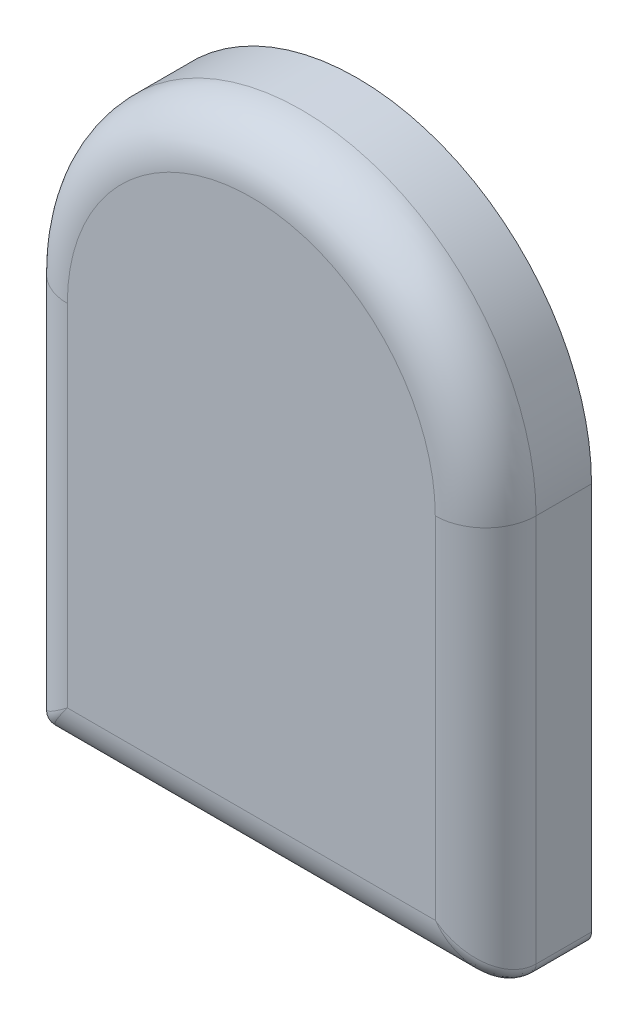
ISO-10303-21;
HEADER;
FILE_DESCRIPTION(('STEP AP214'),'2;1');
FILE_NAME('part.step','',(''),(''),'','','');
FILE_SCHEMA(('AUTOMOTIVE_DESIGN { 1 0 10303 214 1 1 1 1 }'));
ENDSEC;
DATA;
#1=APPLICATION_CONTEXT('core data for automotive mechanical design processes');
#2=APPLICATION_PROTOCOL_DEFINITION('international standard','automotive_design',2000,#1);
#3=PRODUCT_CONTEXT('',#1,'mechanical');
#4=PRODUCT('Part','Part','',(#3));
#5=PRODUCT_RELATED_PRODUCT_CATEGORY('part','',(#4));
#6=PRODUCT_DEFINITION_FORMATION('','',#4);
#7=PRODUCT_DEFINITION_CONTEXT('part definition',#1,'design');
#8=PRODUCT_DEFINITION('design','',#6,#7);
#9=PRODUCT_DEFINITION_SHAPE('','',#8);
#10=(LENGTH_UNIT() NAMED_UNIT(*) SI_UNIT(.MILLI.,.METRE.));
#11=(NAMED_UNIT(*) PLANE_ANGLE_UNIT() SI_UNIT($,.RADIAN.));
#12=(NAMED_UNIT(*) SI_UNIT($,.STERADIAN.) SOLID_ANGLE_UNIT());
#13=UNCERTAINTY_MEASURE_WITH_UNIT(LENGTH_MEASURE(1.E-05),#10,'distance_accuracy_value','');
#14=(GEOMETRIC_REPRESENTATION_CONTEXT(3) GLOBAL_UNCERTAINTY_ASSIGNED_CONTEXT((#13)) GLOBAL_UNIT_ASSIGNED_CONTEXT((#10,
#11,#12)) REPRESENTATION_CONTEXT('',''));
#15=CARTESIAN_POINT('',(0.,0.,0.));
#16=DIRECTION('',(0.,0.,1.));
#17=DIRECTION('',(1.,0.,0.));
#18=AXIS2_PLACEMENT_3D('',#15,#16,#17);
#19=CARTESIAN_POINT('',(8.8,-12.1,4.2));
#20=DIRECTION('',(0.,0.,-1.));
#21=DIRECTION('',(-1.,0.,0.));
#22=AXIS2_PLACEMENT_3D('',#19,#20,#21);
#23=CYLINDRICAL_SURFACE('',#22,0.5);
#24=DIRECTION('',(0.,0.,-1.));
#25=VECTOR('',#24,1.);
#26=CARTESIAN_POINT('',(9.3,-12.1,4.2));
#27=LINE('',#26,#25);
#28=CARTESIAN_POINT('',(9.3,-12.1,2.2));
#29=VERTEX_POINT('',#28);
#30=CARTESIAN_POINT('',(9.3,-12.1,0.));
#31=VERTEX_POINT('',#30);
#32=EDGE_CURVE('E104',#29,#31,#27,.T.);
#33=ORIENTED_EDGE('',*,*,#32,.F.);
#34=CARTESIAN_POINT('',(8.8,-12.1,2.2));
#35=DIRECTION('',(0.,0.,-1.));
#36=DIRECTION('',(-1.,0.,0.));
#37=AXIS2_PLACEMENT_3D('',#34,#35,#36);
#38=CIRCLE('',#37,0.5);
#39=CARTESIAN_POINT('',(8.8,-12.6,2.2));
#40=VERTEX_POINT('',#39);
#41=EDGE_CURVE('E162',#29,#40,#38,.T.);
#42=ORIENTED_EDGE('',*,*,#41,.T.);
#43=DIRECTION('',(0.,0.,-1.));
#44=VECTOR('',#43,1.);
#45=CARTESIAN_POINT('',(8.8,-12.6,4.2));
#46=LINE('',#45,#44);
#47=CARTESIAN_POINT('',(8.8,-12.6,0.));
#48=VERTEX_POINT('',#47);
#49=EDGE_CURVE('E128',#40,#48,#46,.T.);
#50=ORIENTED_EDGE('',*,*,#49,.T.);
#51=CARTESIAN_POINT('',(8.8,-12.1,0.));
#52=DIRECTION('',(0.,0.,1.));
#53=DIRECTION('',(1.,0.,0.));
#54=AXIS2_PLACEMENT_3D('',#51,#52,#53);
#55=CIRCLE('',#54,0.5);
#56=EDGE_CURVE('E122',#48,#31,#55,.T.);
#57=ORIENTED_EDGE('',*,*,#56,.T.);
#58=EDGE_LOOP('',(#33,#42,#50,#57));
#59=FACE_BOUND('',#58,.T.);
#60=ADVANCED_FACE('F39',(#59),#23,.T.);
#61=CARTESIAN_POINT('',(9.3,3.3,4.2));
#62=DIRECTION('',(-1.,0.,0.));
#63=DIRECTION('',(0.,0.,1.));
#64=AXIS2_PLACEMENT_3D('',#61,#62,#63);
#65=PLANE('',#64);
#66=DIRECTION('',(0.,0.,-1.));
#67=VECTOR('',#66,1.);
#68=CARTESIAN_POINT('',(9.3,3.3,4.2));
#69=LINE('',#68,#67);
#70=CARTESIAN_POINT('',(9.3,3.3,2.2));
#71=VERTEX_POINT('',#70);
#72=CARTESIAN_POINT('',(9.3,3.3,0.));
#73=VERTEX_POINT('',#72);
#74=EDGE_CURVE('E116',#71,#73,#69,.T.);
#75=ORIENTED_EDGE('',*,*,#74,.F.);
#76=DIRECTION('',(0.,1.,0.));
#77=VECTOR('',#76,1.);
#78=CARTESIAN_POINT('',(9.3,-12.1,2.2));
#79=LINE('',#78,#77);
#80=EDGE_CURVE('E111',#71,#29,#79,.F.);
#81=ORIENTED_EDGE('',*,*,#80,.T.);
#82=ORIENTED_EDGE('',*,*,#32,.T.);
#83=DIRECTION('',(0.,1.,0.));
#84=VECTOR('',#83,1.);
#85=CARTESIAN_POINT('',(9.3,3.3,0.));
#86=LINE('',#85,#84);
#87=EDGE_CURVE('E108',#31,#73,#86,.T.);
#88=ORIENTED_EDGE('',*,*,#87,.T.);
#89=EDGE_LOOP('',(#75,#81,#82,#88));
#90=FACE_BOUND('',#89,.T.);
#91=ADVANCED_FACE('F107',(#90),#65,.F.);
#92=CARTESIAN_POINT('',(0.,3.3,4.2));
#93=DIRECTION('',(0.,0.,-1.));
#94=DIRECTION('',(-1.,0.,0.));
#95=AXIS2_PLACEMENT_3D('',#92,#93,#94);
#96=CYLINDRICAL_SURFACE('',#95,9.3);
#97=DIRECTION('',(0.,0.,-1.));
#98=VECTOR('',#97,1.);
#99=CARTESIAN_POINT('',(-9.3,3.3,4.2));
#100=LINE('',#99,#98);
#101=CARTESIAN_POINT('',(-9.3,3.3,2.2));
#102=VERTEX_POINT('',#101);
#103=CARTESIAN_POINT('',(-9.3,3.3,0.));
#104=VERTEX_POINT('',#103);
#105=EDGE_CURVE('E148',#102,#104,#100,.T.);
#106=ORIENTED_EDGE('',*,*,#105,.F.);
#107=CARTESIAN_POINT('',(0.,3.3,2.2));
#108=DIRECTION('',(0.,0.,1.));
#109=DIRECTION('',(1.,0.,0.));
#110=AXIS2_PLACEMENT_3D('',#107,#108,#109);
#111=CIRCLE('',#110,9.3);
#112=EDGE_CURVE('E165',#102,#71,#111,.F.);
#113=ORIENTED_EDGE('',*,*,#112,.T.);
#114=ORIENTED_EDGE('',*,*,#74,.T.);
#115=CARTESIAN_POINT('',(0.,3.3,0.));
#116=DIRECTION('',(0.,0.,1.));
#117=DIRECTION('',(1.,0.,0.));
#118=AXIS2_PLACEMENT_3D('',#115,#116,#117);
#119=CIRCLE('',#118,9.3);
#120=EDGE_CURVE('E125',#73,#104,#119,.T.);
#121=ORIENTED_EDGE('',*,*,#120,.T.);
#122=EDGE_LOOP('',(#106,#113,#114,#121));
#123=FACE_BOUND('',#122,.T.);
#124=ADVANCED_FACE('F217',(#123),#96,.T.);
#125=CARTESIAN_POINT('',(-9.3,-12.1,4.2));
#126=DIRECTION('',(1.,0.,0.));
#127=DIRECTION('',(0.,1.,0.));
#128=AXIS2_PLACEMENT_3D('',#125,#126,#127);
#129=PLANE('',#128);
#130=DIRECTION('',(0.,0.,-1.));
#131=VECTOR('',#130,1.);
#132=CARTESIAN_POINT('',(-9.3,-12.1,4.2));
#133=LINE('',#132,#131);
#134=CARTESIAN_POINT('',(-9.3,-12.1,2.2));
#135=VERTEX_POINT('',#134);
#136=CARTESIAN_POINT('',(-9.3,-12.1,0.));
#137=VERTEX_POINT('',#136);
#138=EDGE_CURVE('E146',#135,#137,#133,.T.);
#139=ORIENTED_EDGE('',*,*,#138,.F.);
#140=DIRECTION('',(0.,-1.,0.));
#141=VECTOR('',#140,1.);
#142=CARTESIAN_POINT('',(-9.3,3.3,2.2));
#143=LINE('',#142,#141);
#144=EDGE_CURVE('E48',#135,#102,#143,.F.);
#145=ORIENTED_EDGE('',*,*,#144,.T.);
#146=ORIENTED_EDGE('',*,*,#105,.T.);
#147=DIRECTION('',(0.,-1.,0.));
#148=VECTOR('',#147,1.);
#149=CARTESIAN_POINT('',(-9.3,-12.1,0.));
#150=LINE('',#149,#148);
#151=EDGE_CURVE('E135',#104,#137,#150,.T.);
#152=ORIENTED_EDGE('',*,*,#151,.T.);
#153=EDGE_LOOP('',(#139,#145,#146,#152));
#154=FACE_BOUND('',#153,.T.);
#155=ADVANCED_FACE('F218',(#154),#129,.F.);
#156=CARTESIAN_POINT('',(-8.8,-12.1,4.2));
#157=DIRECTION('',(0.,0.,-1.));
#158=DIRECTION('',(-1.,0.,0.));
#159=AXIS2_PLACEMENT_3D('',#156,#157,#158);
#160=CYLINDRICAL_SURFACE('',#159,0.5);
#161=DIRECTION('',(0.,0.,-1.));
#162=VECTOR('',#161,1.);
#163=CARTESIAN_POINT('',(-8.8,-12.6,4.2));
#164=LINE('',#163,#162);
#165=CARTESIAN_POINT('',(-8.8,-12.6,2.2));
#166=VERTEX_POINT('',#165);
#167=CARTESIAN_POINT('',(-8.8,-12.6,0.));
#168=VERTEX_POINT('',#167);
#169=EDGE_CURVE('E144',#166,#168,#164,.T.);
#170=ORIENTED_EDGE('',*,*,#169,.F.);
#171=CARTESIAN_POINT('',(-8.8,-12.1,2.2));
#172=DIRECTION('',(0.,0.,-1.));
#173=DIRECTION('',(-1.,0.,0.));
#174=AXIS2_PLACEMENT_3D('',#171,#172,#173);
#175=CIRCLE('',#174,0.5);
#176=EDGE_CURVE('E11',#166,#135,#175,.T.);
#177=ORIENTED_EDGE('',*,*,#176,.T.);
#178=ORIENTED_EDGE('',*,*,#138,.T.);
#179=CARTESIAN_POINT('',(-8.8,-12.1,0.));
#180=DIRECTION('',(0.,0.,1.));
#181=DIRECTION('',(1.,0.,0.));
#182=AXIS2_PLACEMENT_3D('',#179,#180,#181);
#183=CIRCLE('',#182,0.5);
#184=EDGE_CURVE('E138',#137,#168,#183,.T.);
#185=ORIENTED_EDGE('',*,*,#184,.T.);
#186=EDGE_LOOP('',(#170,#177,#178,#185));
#187=FACE_BOUND('',#186,.T.);
#188=ADVANCED_FACE('F220',(#187),#160,.T.);
#189=CARTESIAN_POINT('',(8.8,-12.6,4.2));
#190=DIRECTION('',(0.,1.,0.));
#191=DIRECTION('',(0.,0.,1.));
#192=AXIS2_PLACEMENT_3D('',#189,#190,#191);
#193=PLANE('',#192);
#194=ORIENTED_EDGE('',*,*,#49,.F.);
#195=DIRECTION('',(1.,0.,0.));
#196=VECTOR('',#195,1.);
#197=CARTESIAN_POINT('',(-8.8,-12.6,2.2));
#198=LINE('',#197,#196);
#199=EDGE_CURVE('E159',#40,#166,#198,.F.);
#200=ORIENTED_EDGE('',*,*,#199,.T.);
#201=ORIENTED_EDGE('',*,*,#169,.T.);
#202=DIRECTION('',(1.,0.,0.));
#203=VECTOR('',#202,1.);
#204=CARTESIAN_POINT('',(8.8,-12.6,0.));
#205=LINE('',#204,#203);
#206=EDGE_CURVE('E141',#168,#48,#205,.T.);
#207=ORIENTED_EDGE('',*,*,#206,.T.);
#208=EDGE_LOOP('',(#194,#200,#201,#207));
#209=FACE_BOUND('',#208,.T.);
#210=ADVANCED_FACE('F222',(#209),#193,.F.);
#211=CARTESIAN_POINT('',(8.8,-12.1,4.2));
#212=DIRECTION('',(0.,0.,1.));
#213=DIRECTION('',(1.,0.,0.));
#214=AXIS2_PLACEMENT_3D('',#211,#212,#213);
#215=PLANE('',#214);
#216=DIRECTION('',(0.,-1.,0.));
#217=VECTOR('',#216,1.);
#218=CARTESIAN_POINT('',(-7.3,-12.1,4.2));
#219=LINE('',#218,#217);
#220=CARTESIAN_POINT('',(-7.3,3.3,4.2));
#221=VERTEX_POINT('',#220);
#222=CARTESIAN_POINT('',(-7.3,-10.6,4.2));
#223=VERTEX_POINT('',#222);
#224=EDGE_CURVE('E115',#221,#223,#219,.T.);
#225=ORIENTED_EDGE('',*,*,#224,.T.);
#226=DIRECTION('',(1.,0.,0.));
#227=VECTOR('',#226,1.);
#228=CARTESIAN_POINT('',(8.8,-10.6,4.2));
#229=LINE('',#228,#227);
#230=CARTESIAN_POINT('',(7.3,-10.6,4.2));
#231=VERTEX_POINT('',#230);
#232=EDGE_CURVE('E156',#223,#231,#229,.T.);
#233=ORIENTED_EDGE('',*,*,#232,.T.);
#234=DIRECTION('',(0.,1.,0.));
#235=VECTOR('',#234,1.);
#236=CARTESIAN_POINT('',(7.3,3.3,4.2));
#237=LINE('',#236,#235);
#238=CARTESIAN_POINT('',(7.3,3.3,4.2));
#239=VERTEX_POINT('',#238);
#240=EDGE_CURVE('E154',#231,#239,#237,.T.);
#241=ORIENTED_EDGE('',*,*,#240,.T.);
#242=CARTESIAN_POINT('',(0.,3.3,4.2));
#243=DIRECTION('',(0.,0.,1.));
#244=DIRECTION('',(1.,0.,0.));
#245=AXIS2_PLACEMENT_3D('',#242,#243,#244);
#246=CIRCLE('',#245,7.3);
#247=EDGE_CURVE('E152',#239,#221,#246,.T.);
#248=ORIENTED_EDGE('',*,*,#247,.T.);
#249=EDGE_LOOP('',(#225,#233,#241,#248));
#250=FACE_BOUND('',#249,.T.);
#251=ADVANCED_FACE('F228',(#250),#215,.T.);
#252=CARTESIAN_POINT('',(8.8,-12.1,0.));
#253=DIRECTION('',(0.,0.,1.));
#254=DIRECTION('',(1.,0.,0.));
#255=AXIS2_PLACEMENT_3D('',#252,#253,#254);
#256=PLANE('',#255);
#257=ORIENTED_EDGE('',*,*,#56,.F.);
#258=ORIENTED_EDGE('',*,*,#206,.F.);
#259=ORIENTED_EDGE('',*,*,#184,.F.);
#260=ORIENTED_EDGE('',*,*,#151,.F.);
#261=ORIENTED_EDGE('',*,*,#120,.F.);
#262=ORIENTED_EDGE('',*,*,#87,.F.);
#263=EDGE_LOOP('',(#257,#258,#259,#260,#261,#262));
#264=FACE_BOUND('',#263,.T.);
#265=ADVANCED_FACE('F120',(#264),#256,.F.);
#266=CARTESIAN_POINT('',(0.,3.3,2.2));
#267=DIRECTION('',(0.,0.,1.));
#268=DIRECTION('',(1.,0.,0.));
#269=AXIS2_PLACEMENT_3D('',#266,#267,#268);
#270=TOROIDAL_SURFACE('',#269,7.3,2.);
#271=CARTESIAN_POINT('',(7.3,3.3,2.2));
#272=DIRECTION('',(0.,-1.,0.));
#273=DIRECTION('',(0.,0.,-1.));
#274=AXIS2_PLACEMENT_3D('',#271,#272,#273);
#275=CIRCLE('',#274,2.);
#276=EDGE_CURVE('E132',#71,#239,#275,.T.);
#277=ORIENTED_EDGE('',*,*,#276,.F.);
#278=ORIENTED_EDGE('',*,*,#112,.F.);
#279=CARTESIAN_POINT('',(-7.3,3.3,2.2));
#280=DIRECTION('',(0.,-1.,0.));
#281=DIRECTION('',(1.,0.,0.));
#282=AXIS2_PLACEMENT_3D('',#279,#280,#281);
#283=CIRCLE('',#282,2.);
#284=EDGE_CURVE('E43',#221,#102,#283,.T.);
#285=ORIENTED_EDGE('',*,*,#284,.F.);
#286=ORIENTED_EDGE('',*,*,#247,.F.);
#287=EDGE_LOOP('',(#277,#278,#285,#286));
#288=FACE_BOUND('',#287,.T.);
#289=ADVANCED_FACE('F41',(#288),#270,.T.);
#290=CARTESIAN_POINT('',(-7.3,-12.1,2.2));
#291=DIRECTION('',(0.,1.,0.));
#292=DIRECTION('',(-1.,0.,0.));
#293=AXIS2_PLACEMENT_3D('',#290,#291,#292);
#294=CYLINDRICAL_SURFACE('',#293,2.);
#295=ORIENTED_EDGE('',*,*,#284,.T.);
#296=ORIENTED_EDGE('',*,*,#144,.F.);
#297=CARTESIAN_POINT('',(-7.3,-10.6,2.2));
#298=DIRECTION('',(0.6,-0.8,0.));
#299=DIRECTION('',(-0.8,-0.6,0.));
#300=AXIS2_PLACEMENT_3D('',#297,#298,#299);
#301=ELLIPSE('',#300,2.5,2.);
#302=EDGE_CURVE('E175',#223,#135,#301,.T.);
#303=ORIENTED_EDGE('',*,*,#302,.F.);
#304=ORIENTED_EDGE('',*,*,#224,.F.);
#305=EDGE_LOOP('',(#295,#296,#303,#304));
#306=FACE_BOUND('',#305,.T.);
#307=ADVANCED_FACE('F195',(#306),#294,.T.);
#308=CARTESIAN_POINT('',(7.3,-12.1,2.2));
#309=DIRECTION('',(0.,-1.,0.));
#310=DIRECTION('',(0.,0.,-1.));
#311=AXIS2_PLACEMENT_3D('',#308,#309,#310);
#312=CYLINDRICAL_SURFACE('',#311,2.);
#313=ORIENTED_EDGE('',*,*,#276,.T.);
#314=ORIENTED_EDGE('',*,*,#240,.F.);
#315=CARTESIAN_POINT('',(7.3,-10.6,2.2));
#316=DIRECTION('',(0.6,0.8,0.));
#317=DIRECTION('',(0.8,-0.6,0.));
#318=AXIS2_PLACEMENT_3D('',#315,#316,#317);
#319=ELLIPSE('',#318,2.5,2.);
#320=EDGE_CURVE('E172',#29,#231,#319,.F.);
#321=ORIENTED_EDGE('',*,*,#320,.F.);
#322=ORIENTED_EDGE('',*,*,#80,.F.);
#323=EDGE_LOOP('',(#313,#314,#321,#322));
#324=FACE_BOUND('',#323,.T.);
#325=ADVANCED_FACE('F191',(#324),#312,.T.);
#326=CARTESIAN_POINT('',(-7.3,-10.6,0.200000000000001));
#327=CARTESIAN_POINT('',(-7.3,-10.6,0.200000000000001));
#328=CARTESIAN_POINT('',(-7.3,-10.6,0.200000000000001));
#329=CARTESIAN_POINT('',(-7.36534712065569,-10.6871294942076,0.200035055250015));
#330=CARTESIAN_POINT('',(-7.37625301968526,-10.6762530196853,0.199976339095898));
#331=CARTESIAN_POINT('',(-7.38712949420759,-10.6653471206557,0.200035055250015));
#332=CARTESIAN_POINT('',(-7.43071092668624,-10.7742812355817,0.205696487430835));
#333=CARTESIAN_POINT('',(-7.45271669848803,-10.752716698488,0.204277360821934));
#334=CARTESIAN_POINT('',(-7.47428123558166,-10.7307109266862,0.205696487430835));
#335=CARTESIAN_POINT('',(-7.56031449090428,-10.9470859878724,0.228427051088899));
#336=CARTESIAN_POINT('',(-7.60446975212246,-10.9044697521225,0.22140059823371));
#337=CARTESIAN_POINT('',(-7.64708598787237,-10.8603144909043,0.228427051088899));
#338=CARTESIAN_POINT('',(-7.62455908096206,-11.0327454412827,0.245398809321809));
#339=CARTESIAN_POINT('',(-7.68019165762918,-10.9801916576292,0.234247025705178));
#340=CARTESIAN_POINT('',(-7.73274544128274,-10.9245590809621,0.245398809321809));
#341=CARTESIAN_POINT('',(-7.75083012894728,-11.2011068385964,0.290516308556291));
#342=CARTESIAN_POINT('',(-7.82973753195478,-11.1297375319548,0.268479521630331));
#343=CARTESIAN_POINT('',(-7.90110683859638,-11.0508301289473,0.290516308556291));
#344=CARTESIAN_POINT('',(-7.81287571744484,-11.2838342899265,0.318469854155509));
#345=CARTESIAN_POINT('',(-7.90398851452828,-11.2039885145283,0.289912895749702));
#346=CARTESIAN_POINT('',(-7.98383428992645,-11.1128757174448,0.318469854155509));
#347=CARTESIAN_POINT('',(-7.93366820048003,-11.4448909339734,0.385180085693134));
#348=CARTESIAN_POINT('',(-8.04991425185414,-11.3499142518541,0.341360606992456));
#349=CARTESIAN_POINT('',(-8.14489093397337,-11.23366820048,0.385180085693134));
#350=CARTESIAN_POINT('',(-7.99245870376998,-11.5232782716933,0.423653679114348));
#351=CARTESIAN_POINT('',(-8.12200143121126,-11.4220014312113,0.371441966476322));
#352=CARTESIAN_POINT('',(-8.22327827169331,-11.29245870377,0.423653679114348));
#353=CARTESIAN_POINT('',(-8.10570975300993,-11.6742796706799,0.510834776663723));
#354=CARTESIAN_POINT('',(-8.26295325731846,-11.5629532573185,0.440367062406523));
#355=CARTESIAN_POINT('',(-8.3742796706799,-11.4057097530099,0.510834776663724));
#356=CARTESIAN_POINT('',(-8.1602485580067,-11.7469980773423,0.559177555106217));
#357=CARTESIAN_POINT('',(-8.33220337416109,-11.6322033741611,0.479288917524901));
#358=CARTESIAN_POINT('',(-8.44699807734226,-11.4602485580067,0.559177555106218));
#359=CARTESIAN_POINT('',(-8.26402611496821,-11.8853681532909,0.665353034789945));
#360=CARTESIAN_POINT('',(-8.46682192510474,-11.7668219251047,0.566297856684954));
#361=CARTESIAN_POINT('',(-8.58536815329094,-11.5640261149682,0.665353034789946));
#362=CARTESIAN_POINT('',(-8.31338750743845,-11.9511833432513,0.722755397155792));
#363=CARTESIAN_POINT('',(-8.53252990498461,-11.8325299049846,0.614455680376174));
#364=CARTESIAN_POINT('',(-8.65118334325127,-11.6133875074385,0.722755397155792));
#365=CARTESIAN_POINT('',(-8.40591892041319,-12.0745585605509,0.846132222162794));
#366=CARTESIAN_POINT('',(-8.65927843911775,-11.9592784391177,0.72064706325371));
#367=CARTESIAN_POINT('',(-8.77455856055092,-11.7059189204132,0.846132222162793));
#368=CARTESIAN_POINT('',(-8.44926311849199,-12.132350824656,0.911637313282867));
#369=CARTESIAN_POINT('',(-8.72058796060971,-12.0205879606097,0.77870927589382));
#370=CARTESIAN_POINT('',(-8.83235082465598,-11.749263118492,0.911637313282867));
#371=CARTESIAN_POINT('',(-8.52896450999682,-12.2386193466624,1.05013285836796));
#372=CARTESIAN_POINT('',(-8.83742230607737,-12.1374223060774,0.905718655842486));
#373=CARTESIAN_POINT('',(-8.93861934666242,-11.8289645099968,1.05013285836796));
#374=CARTESIAN_POINT('',(-8.56554818620167,-12.2873975816022,1.12265451812362));
#375=CARTESIAN_POINT('',(-8.893119014594,-12.193119014594,0.974594782404193));
#376=CARTESIAN_POINT('',(-8.98739758160222,-11.8655481862017,1.12265451812362));
#377=CARTESIAN_POINT('',(-8.63104897214961,-12.3747319628661,1.27392958631864));
#378=CARTESIAN_POINT('',(-8.99700237456934,-12.2970023745693,1.12428825163707));
#379=CARTESIAN_POINT('',(-9.07473196286614,-11.9310489721496,1.27392958631864));
#380=CARTESIAN_POINT('',(-8.66023331373321,-12.4136444183109,1.35226632370846));
#381=CARTESIAN_POINT('',(-9.04524564728287,-12.3452456472829,1.20485256451251));
#382=CARTESIAN_POINT('',(-9.11364441831094,-11.9602333137332,1.35226632370846));
#383=CARTESIAN_POINT('',(-8.71039789563343,-12.4805305275112,1.51375694675793));
#384=CARTESIAN_POINT('',(-9.13168487740083,-12.4316848774008,1.37835057694996));
#385=CARTESIAN_POINT('',(-9.18053052751125,-12.0103978956334,1.51375694675793));
#386=CARTESIAN_POINT('',(-8.73165591145982,-12.5088745486131,1.59659973042092));
#387=CARTESIAN_POINT('',(-9.16982930810949,-12.4698293081095,1.47075659896622));
#388=CARTESIAN_POINT('',(-9.20887454861309,-12.0316559114598,1.59659973042092));
#389=CARTESIAN_POINT('',(-8.76560412617006,-12.5541388348934,1.76554895244281));
#390=CARTESIAN_POINT('',(-9.23291592445389,-12.5329159244539,1.6666663568643));
#391=CARTESIAN_POINT('',(-9.25413883489341,-12.0656041261701,1.76554895244281));
#392=CARTESIAN_POINT('',(-8.7785324204649,-12.5713765606199,1.85148270452044));
#393=CARTESIAN_POINT('',(-9.25774658379329,-12.5577465837933,1.76930869505542));
#394=CARTESIAN_POINT('',(-9.27137656061987,-12.0785324204649,1.85148270452044));
#395=CARTESIAN_POINT('',(-8.79566049473916,-12.5942139929855,2.0249775244552));
#396=CARTESIAN_POINT('',(-9.29133353940984,-12.5913335394098,1.98185786072974));
#397=CARTESIAN_POINT('',(-9.29421399298555,-12.0956604947392,2.0249775244552));
#398=CARTESIAN_POINT('',(-8.8,-12.6,2.1124887622276));
#399=CARTESIAN_POINT('',(-9.3,-12.6,2.0906106505444));
#400=CARTESIAN_POINT('',(-9.3,-12.1,2.1124887622276));
#401=CARTESIAN_POINT('',(-8.8,-12.6,2.2875112377724));
#402=CARTESIAN_POINT('',(-9.3,-12.6,2.30938934945561));
#403=CARTESIAN_POINT('',(-9.3,-12.1,2.2875112377724));
#404=CARTESIAN_POINT('',(-8.79566049473916,-12.5942139929855,2.37502247554481));
#405=CARTESIAN_POINT('',(-9.29133353940984,-12.5913335394098,2.41814213927026));
#406=CARTESIAN_POINT('',(-9.29421399298555,-12.0956604947392,2.37502247554481));
#407=CARTESIAN_POINT('',(-8.7785324204649,-12.5713765606199,2.54851729547956));
#408=CARTESIAN_POINT('',(-9.25774658379329,-12.5577465837933,2.63069130494458));
#409=CARTESIAN_POINT('',(-9.27137656061987,-12.0785324204649,2.54851729547956));
#410=CARTESIAN_POINT('',(-8.76560412617006,-12.5541388348934,2.63445104755719));
#411=CARTESIAN_POINT('',(-9.23291592445389,-12.5329159244539,2.7333336431357));
#412=CARTESIAN_POINT('',(-9.25413883489341,-12.0656041261701,2.63445104755719));
#413=CARTESIAN_POINT('',(-8.73165591145982,-12.5088745486131,2.80340026957908));
#414=CARTESIAN_POINT('',(-9.16982930810949,-12.4698293081095,2.92924340103378));
#415=CARTESIAN_POINT('',(-9.20887454861309,-12.0316559114598,2.80340026957908));
#416=CARTESIAN_POINT('',(-8.71039789563343,-12.4805305275113,2.88624305324207));
#417=CARTESIAN_POINT('',(-9.13168487740083,-12.4316848774008,3.02164942305004));
#418=CARTESIAN_POINT('',(-9.18053052751125,-12.0103978956334,2.88624305324207));
#419=CARTESIAN_POINT('',(-8.66023331373321,-12.4136444183109,3.04773367629154));
#420=CARTESIAN_POINT('',(-9.04524564728287,-12.3452456472829,3.19514743548749));
#421=CARTESIAN_POINT('',(-9.11364441831094,-11.9602333137332,3.04773367629154));
#422=CARTESIAN_POINT('',(-8.63104897214961,-12.3747319628661,3.12607041368136));
#423=CARTESIAN_POINT('',(-8.99700237456934,-12.2970023745693,3.27571174836293));
#424=CARTESIAN_POINT('',(-9.07473196286614,-11.9310489721496,3.12607041368136));
#425=CARTESIAN_POINT('',(-8.56554818620167,-12.2873975816022,3.27734548187638));
#426=CARTESIAN_POINT('',(-8.893119014594,-12.193119014594,3.42540521759581));
#427=CARTESIAN_POINT('',(-8.98739758160222,-11.8655481862017,3.27734548187638));
#428=CARTESIAN_POINT('',(-8.52896450999682,-12.2386193466624,3.34986714163205));
#429=CARTESIAN_POINT('',(-8.83742230607737,-12.1374223060774,3.49428134415751));
#430=CARTESIAN_POINT('',(-8.93861934666242,-11.8289645099968,3.34986714163205));
#431=CARTESIAN_POINT('',(-8.44926311849199,-12.132350824656,3.48836268671713));
#432=CARTESIAN_POINT('',(-8.72058796060971,-12.0205879606097,3.62129072410618));
#433=CARTESIAN_POINT('',(-8.83235082465598,-11.749263118492,3.48836268671713));
#434=CARTESIAN_POINT('',(-8.40591892041319,-12.0745585605509,3.55386777783721));
#435=CARTESIAN_POINT('',(-8.65927843911775,-11.9592784391177,3.67935293674629));
#436=CARTESIAN_POINT('',(-8.77455856055092,-11.7059189204132,3.55386777783721));
#437=CARTESIAN_POINT('',(-8.31338750743845,-11.9511833432513,3.67724460284421));
#438=CARTESIAN_POINT('',(-8.53252990498461,-11.8325299049846,3.78554431962383));
#439=CARTESIAN_POINT('',(-8.65118334325127,-11.6133875074385,3.67724460284421));
#440=CARTESIAN_POINT('',(-8.26402611496821,-11.8853681532909,3.73464696521006));
#441=CARTESIAN_POINT('',(-8.46682192510474,-11.7668219251047,3.83370214331505));
#442=CARTESIAN_POINT('',(-8.58536815329094,-11.5640261149682,3.73464696521006));
#443=CARTESIAN_POINT('',(-8.1602485580067,-11.7469980773423,3.84082244489378));
#444=CARTESIAN_POINT('',(-8.33220337416109,-11.6322033741611,3.9207110824751));
#445=CARTESIAN_POINT('',(-8.44699807734226,-11.4602485580067,3.84082244489378));
#446=CARTESIAN_POINT('',(-8.10570975300993,-11.6742796706799,3.88916522333628));
#447=CARTESIAN_POINT('',(-8.26295325731846,-11.5629532573185,3.95963293759348));
#448=CARTESIAN_POINT('',(-8.3742796706799,-11.4057097530099,3.88916522333628));
#449=CARTESIAN_POINT('',(-7.99245870376998,-11.5232782716933,3.97634632088565));
#450=CARTESIAN_POINT('',(-8.12200143121126,-11.4220014312113,4.02855803352368));
#451=CARTESIAN_POINT('',(-8.22327827169331,-11.29245870377,3.97634632088565));
#452=CARTESIAN_POINT('',(-7.93366820048003,-11.4448909339734,4.01481991430687));
#453=CARTESIAN_POINT('',(-8.04991425185414,-11.3499142518541,4.05863939300755));
#454=CARTESIAN_POINT('',(-8.14489093397337,-11.23366820048,4.01481991430687));
#455=CARTESIAN_POINT('',(-7.81287571744484,-11.2838342899265,4.08153014584449));
#456=CARTESIAN_POINT('',(-7.90398851452829,-11.2039885145283,4.1100871042503));
#457=CARTESIAN_POINT('',(-7.98383428992646,-11.1128757174448,4.08153014584449));
#458=CARTESIAN_POINT('',(-7.75083012894728,-11.2011068385964,4.10948369144371));
#459=CARTESIAN_POINT('',(-7.82973753195478,-11.1297375319548,4.13152047836967));
#460=CARTESIAN_POINT('',(-7.90110683859638,-11.0508301289473,4.10948369144371));
#461=CARTESIAN_POINT('',(-7.62455908096206,-11.0327454412827,4.15460119067819));
#462=CARTESIAN_POINT('',(-7.68019165762918,-10.9801916576292,4.16575297429482));
#463=CARTESIAN_POINT('',(-7.73274544128274,-10.9245590809621,4.15460119067819));
#464=CARTESIAN_POINT('',(-7.56031449090428,-10.9470859878724,4.1715729489111));
#465=CARTESIAN_POINT('',(-7.60446975212246,-10.9044697521225,4.17859940176629));
#466=CARTESIAN_POINT('',(-7.64708598787237,-10.8603144909043,4.1715729489111));
#467=CARTESIAN_POINT('',(-7.43071092668624,-10.7742812355817,4.19430351256917));
#468=CARTESIAN_POINT('',(-7.45271669848803,-10.752716698488,4.19572263917807));
#469=CARTESIAN_POINT('',(-7.47428123558166,-10.7307109266862,4.19430351256917));
#470=CARTESIAN_POINT('',(-7.3653471206557,-10.6871294942076,4.19996494474999));
#471=CARTESIAN_POINT('',(-7.37625301968526,-10.6762530196853,4.2000236609041));
#472=CARTESIAN_POINT('',(-7.38712949420759,-10.6653471206557,4.19996494474999));
#473=CARTESIAN_POINT('',(-7.3,-10.6,4.2));
#474=CARTESIAN_POINT('',(-7.3,-10.6,4.2));
#475=CARTESIAN_POINT('',(-7.3,-10.6,4.2));
#476=(BOUNDED_SURFACE() B_SPLINE_SURFACE(3,2,((#326,#327,#328),(#329,#330,#331),(#332,#333,
#334),(#335,#336,#337),(#338,#339,#340),(#341,#342,#343),(#344,#345,#346),(#347,#348,#349),
(#350,#351,#352),(#353,#354,#355),(#356,#357,#358),(#359,#360,#361),(#362,#363,#364),(#365,#366,
#367),(#368,#369,#370),(#371,#372,#373),(#374,#375,#376),(#377,#378,#379),(#380,#381,#382),
(#383,#384,#385),(#386,#387,#388),(#389,#390,#391),(#392,#393,#394),(#395,#396,#397),(#398,#399,
#400),(#401,#402,#403),(#404,#405,#406),(#407,#408,#409),(#410,#411,#412),(#413,#414,#415),
(#416,#417,#418),(#419,#420,#421),(#422,#423,#424),(#425,#426,#427),(#428,#429,#430),(#431,#432,
#433),(#434,#435,#436),(#437,#438,#439),(#440,#441,#442),(#443,#444,#445),(#446,#447,#448),
(#449,#450,#451),(#452,#453,#454),(#455,#456,#457),(#458,#459,#460),(#461,#462,#463),(#464,#465,
#466),(#467,#468,#469),(#470,#471,#472),(#473,#474,#475)),.UNSPECIFIED.,.F.,.F.,
.F.) B_SPLINE_SURFACE_WITH_KNOTS((4,2,2,2,2,2,2,2,2,2,2,2,2,2,2,2,2,2,2,2,2,2,2,2,4),(3,3),(0.,
0.277185081205051,0.552014119053092,0.822233461976019,1.08579611517548,1.34096955189626,
1.58644804888033,1.82146864153553,2.04592551633704,2.26046944958155,2.4665662185127,
2.66647462606246,2.86310321556792,3.05973180507339,3.25964021262314,3.46573698155429,
3.6802809147988,3.90473778960032,4.13975838225551,4.38523687923959,4.64041031596037,
4.90397296915983,5.17419231208275,5.44902134993079,5.72620643113585),(0.,1.),
.UNSPECIFIED.) GEOMETRIC_REPRESENTATION_ITEM() RATIONAL_B_SPLINE_SURFACE(((1.,1.,1.),(1.,
1.00000566557019,1.),(1.,0.998576699090688,1.),(1.,0.992910721279765,1.),(1.,0.988697681267574,
1.),(1.,0.97761712883305,1.),(1.,0.970795325018433,1.),(1.,0.954789124900482,1.),(1.,
0.945667069465631,1.),(1.,0.92548796875733,1.),(1.,0.914501756375306,1.),(1.,0.891169998194024,
1.),(1.,0.878891956959708,1.),(1.,0.853706993048538,1.),(1.,0.84084914596985,1.),(1.,
0.815387454422431,1.),(1.,0.802798170091792,1.),(1.,0.778880732263429,1.),(1.,0.767521437046521,
1.),(1.,0.747118526989836,1.),(1.,0.738001346912332,1.),(1.,0.723039691293395,1.),(1.,
0.717105167896984,1.),(1.,0.709170186451793,1.),(1.,0.707106781186548,1.),(1.,0.707106781186548,
1.),(1.,0.709170186451793,1.),(1.,0.717105167896984,1.),(1.,0.723039691293395,1.),(1.,
0.738001346912332,1.),(1.,0.747118526989835,1.),(1.,0.767521437046521,1.),(1.,0.778880732263429,
1.),(1.,0.802798170091792,1.),(1.,0.815387454422431,1.),(1.,0.84084914596985,1.),(1.,
0.853706993048538,1.),(1.,0.878891956959708,1.),(1.,0.891169998194024,1.),(1.,0.914501756375306,
1.),(1.,0.92548796875733,1.),(1.,0.945667069465631,1.),(1.,0.954789124900482,1.),(1.,
0.970795325018433,1.),(1.,0.97761712883305,1.),(1.,0.988697681267574,1.),(1.,0.992910721279765,
1.),(1.,0.998576699090688,1.),(1.,1.00000566557019,1.),(1.,1.,1.))) REPRESENTATION_ITEM('') SURFACE());
#477=ORIENTED_EDGE('',*,*,#302,.T.);
#478=ORIENTED_EDGE('',*,*,#176,.F.);
#479=CARTESIAN_POINT('',(-7.3,-10.6,2.2));
#480=DIRECTION('',(0.8,-0.6,0.));
#481=DIRECTION('',(-0.6,-0.8,0.));
#482=AXIS2_PLACEMENT_3D('',#479,#480,#481);
#483=ELLIPSE('',#482,2.5,2.);
#484=EDGE_CURVE('E170',#223,#166,#483,.T.);
#485=ORIENTED_EDGE('',*,*,#484,.F.);
#486=EDGE_LOOP('',(#477,#478,#485));
#487=FACE_BOUND('',#486,.T.);
#488=ADVANCED_FACE('F187',(#487),#476,.T.);
#489=CARTESIAN_POINT('',(7.3,-10.6,0.200000000000001));
#490=CARTESIAN_POINT('',(7.3,-10.6,0.200000000000001));
#491=CARTESIAN_POINT('',(7.3,-10.6,0.200000000000001));
#492=CARTESIAN_POINT('',(7.38712949420759,-10.6653471206557,0.200035055250015));
#493=CARTESIAN_POINT('',(7.37625301968526,-10.6762530196853,0.199976339095899));
#494=CARTESIAN_POINT('',(7.3653471206557,-10.6871294942076,0.200035055250015));
#495=CARTESIAN_POINT('',(7.47428123558166,-10.7307109266862,0.205696487430835));
#496=CARTESIAN_POINT('',(7.45271669848803,-10.752716698488,0.204277360821935));
#497=CARTESIAN_POINT('',(7.43071092668625,-10.7742812355817,0.205696487430835));
#498=CARTESIAN_POINT('',(7.64708598787237,-10.8603144909043,0.228427051088899));
#499=CARTESIAN_POINT('',(7.60446975212246,-10.9044697521225,0.22140059823371));
#500=CARTESIAN_POINT('',(7.56031449090428,-10.9470859878724,0.228427051088899));
#501=CARTESIAN_POINT('',(7.73274544128274,-10.9245590809621,0.245398809321809));
#502=CARTESIAN_POINT('',(7.68019165762918,-10.9801916576292,0.234247025705178));
#503=CARTESIAN_POINT('',(7.62455908096206,-11.0327454412827,0.245398809321809));
#504=CARTESIAN_POINT('',(7.90110683859638,-11.0508301289473,0.290516308556291));
#505=CARTESIAN_POINT('',(7.82973753195478,-11.1297375319548,0.268479521630331));
#506=CARTESIAN_POINT('',(7.75083012894728,-11.2011068385964,0.290516308556291));
#507=CARTESIAN_POINT('',(7.98383428992646,-11.1128757174448,0.318469854155509));
#508=CARTESIAN_POINT('',(7.90398851452829,-11.2039885145283,0.289912895749702));
#509=CARTESIAN_POINT('',(7.81287571744484,-11.2838342899265,0.318469854155509));
#510=CARTESIAN_POINT('',(8.14489093397337,-11.23366820048,0.385180085693134));
#511=CARTESIAN_POINT('',(8.04991425185414,-11.3499142518541,0.341360606992456));
#512=CARTESIAN_POINT('',(7.93366820048003,-11.4448909339734,0.385180085693134));
#513=CARTESIAN_POINT('',(8.22327827169331,-11.29245870377,0.423653679114348));
#514=CARTESIAN_POINT('',(8.12200143121127,-11.4220014312113,0.371441966476322));
#515=CARTESIAN_POINT('',(7.99245870376998,-11.5232782716933,0.423653679114348));
#516=CARTESIAN_POINT('',(8.3742796706799,-11.4057097530099,0.510834776663724));
#517=CARTESIAN_POINT('',(8.26295325731846,-11.5629532573185,0.440367062406523));
#518=CARTESIAN_POINT('',(8.10570975300993,-11.6742796706799,0.510834776663724));
#519=CARTESIAN_POINT('',(8.44699807734226,-11.4602485580067,0.559177555106217));
#520=CARTESIAN_POINT('',(8.33220337416109,-11.6322033741611,0.479288917524901));
#521=CARTESIAN_POINT('',(8.1602485580067,-11.7469980773423,0.559177555106217));
#522=CARTESIAN_POINT('',(8.58536815329094,-11.5640261149682,0.665353034789945));
#523=CARTESIAN_POINT('',(8.46682192510474,-11.7668219251047,0.566297856684954));
#524=CARTESIAN_POINT('',(8.26402611496821,-11.8853681532909,0.665353034789945));
#525=CARTESIAN_POINT('',(8.65118334325127,-11.6133875074385,0.722755397155792));
#526=CARTESIAN_POINT('',(8.53252990498461,-11.8325299049846,0.614455680376174));
#527=CARTESIAN_POINT('',(8.31338750743845,-11.9511833432513,0.722755397155792));
#528=CARTESIAN_POINT('',(8.77455856055092,-11.7059189204132,0.846132222162794));
#529=CARTESIAN_POINT('',(8.65927843911775,-11.9592784391178,0.72064706325371));
#530=CARTESIAN_POINT('',(8.40591892041319,-12.0745585605509,0.846132222162794));
#531=CARTESIAN_POINT('',(8.83235082465598,-11.749263118492,0.911637313282867));
#532=CARTESIAN_POINT('',(8.72058796060972,-12.0205879606097,0.77870927589382));
#533=CARTESIAN_POINT('',(8.44926311849199,-12.132350824656,0.911637313282867));
#534=CARTESIAN_POINT('',(8.93861934666242,-11.8289645099968,1.05013285836796));
#535=CARTESIAN_POINT('',(8.83742230607737,-12.1374223060774,0.905718655842486));
#536=CARTESIAN_POINT('',(8.52896450999682,-12.2386193466624,1.05013285836796));
#537=CARTESIAN_POINT('',(8.98739758160223,-11.8655481862017,1.12265451812362));
#538=CARTESIAN_POINT('',(8.893119014594,-12.193119014594,0.974594782404194));
#539=CARTESIAN_POINT('',(8.56554818620167,-12.2873975816022,1.12265451812362));
#540=CARTESIAN_POINT('',(9.07473196286614,-11.9310489721496,1.27392958631864));
#541=CARTESIAN_POINT('',(8.99700237456934,-12.2970023745693,1.12428825163707));
#542=CARTESIAN_POINT('',(8.63104897214961,-12.3747319628661,1.27392958631864));
#543=CARTESIAN_POINT('',(9.11364441831095,-11.9602333137332,1.35226632370846));
#544=CARTESIAN_POINT('',(9.04524564728287,-12.3452456472829,1.20485256451251));
#545=CARTESIAN_POINT('',(8.66023331373321,-12.4136444183109,1.35226632370846));
#546=CARTESIAN_POINT('',(9.18053052751125,-12.0103978956334,1.51375694675793));
#547=CARTESIAN_POINT('',(9.13168487740083,-12.4316848774008,1.37835057694997));
#548=CARTESIAN_POINT('',(8.71039789563344,-12.4805305275112,1.51375694675793));
#549=CARTESIAN_POINT('',(9.2088745486131,-12.0316559114598,1.59659973042092));
#550=CARTESIAN_POINT('',(9.16982930810949,-12.4698293081095,1.47075659896622));
#551=CARTESIAN_POINT('',(8.73165591145982,-12.5088745486131,1.59659973042092));
#552=CARTESIAN_POINT('',(9.25413883489341,-12.0656041261701,1.76554895244281));
#553=CARTESIAN_POINT('',(9.23291592445389,-12.5329159244539,1.6666663568643));
#554=CARTESIAN_POINT('',(8.76560412617006,-12.5541388348934,1.76554895244281));
#555=CARTESIAN_POINT('',(9.27137656061987,-12.0785324204649,1.85148270452044));
#556=CARTESIAN_POINT('',(9.25774658379329,-12.5577465837933,1.76930869505542));
#557=CARTESIAN_POINT('',(8.77853242046491,-12.5713765606199,1.85148270452044));
#558=CARTESIAN_POINT('',(9.29421399298555,-12.0956604947392,2.0249775244552));
#559=CARTESIAN_POINT('',(9.29133353940984,-12.5913335394098,1.98185786072974));
#560=CARTESIAN_POINT('',(8.79566049473916,-12.5942139929855,2.0249775244552));
#561=CARTESIAN_POINT('',(9.3,-12.1,2.1124887622276));
#562=CARTESIAN_POINT('',(9.3,-12.6,2.0906106505444));
#563=CARTESIAN_POINT('',(8.8,-12.6,2.1124887622276));
#564=CARTESIAN_POINT('',(9.3,-12.1,2.2875112377724));
#565=CARTESIAN_POINT('',(9.3,-12.6,2.30938934945561));
#566=CARTESIAN_POINT('',(8.8,-12.6,2.2875112377724));
#567=CARTESIAN_POINT('',(9.29421399298555,-12.0956604947392,2.37502247554481));
#568=CARTESIAN_POINT('',(9.29133353940984,-12.5913335394098,2.41814213927026));
#569=CARTESIAN_POINT('',(8.79566049473916,-12.5942139929855,2.37502247554481));
#570=CARTESIAN_POINT('',(9.27137656061987,-12.0785324204649,2.54851729547956));
#571=CARTESIAN_POINT('',(9.25774658379329,-12.5577465837933,2.63069130494458));
#572=CARTESIAN_POINT('',(8.77853242046491,-12.5713765606199,2.54851729547956));
#573=CARTESIAN_POINT('',(9.25413883489341,-12.0656041261701,2.63445104755719));
#574=CARTESIAN_POINT('',(9.23291592445389,-12.5329159244539,2.7333336431357));
#575=CARTESIAN_POINT('',(8.76560412617006,-12.5541388348934,2.63445104755719));
#576=CARTESIAN_POINT('',(9.2088745486131,-12.0316559114598,2.80340026957908));
#577=CARTESIAN_POINT('',(9.1698293081095,-12.4698293081095,2.92924340103378));
#578=CARTESIAN_POINT('',(8.73165591145982,-12.5088745486131,2.80340026957908));
#579=CARTESIAN_POINT('',(9.18053052751125,-12.0103978956334,2.88624305324207));
#580=CARTESIAN_POINT('',(9.13168487740083,-12.4316848774008,3.02164942305004));
#581=CARTESIAN_POINT('',(8.71039789563344,-12.4805305275113,2.88624305324207));
#582=CARTESIAN_POINT('',(9.11364441831095,-11.9602333137332,3.04773367629154));
#583=CARTESIAN_POINT('',(9.04524564728287,-12.3452456472829,3.19514743548749));
#584=CARTESIAN_POINT('',(8.66023331373321,-12.4136444183109,3.04773367629154));
#585=CARTESIAN_POINT('',(9.07473196286614,-11.9310489721496,3.12607041368136));
#586=CARTESIAN_POINT('',(8.99700237456934,-12.2970023745693,3.27571174836293));
#587=CARTESIAN_POINT('',(8.63104897214961,-12.3747319628661,3.12607041368136));
#588=CARTESIAN_POINT('',(8.98739758160223,-11.8655481862017,3.27734548187638));
#589=CARTESIAN_POINT('',(8.893119014594,-12.193119014594,3.42540521759581));
#590=CARTESIAN_POINT('',(8.56554818620167,-12.2873975816022,3.27734548187638));
#591=CARTESIAN_POINT('',(8.93861934666242,-11.8289645099968,3.34986714163205));
#592=CARTESIAN_POINT('',(8.83742230607736,-12.1374223060774,3.49428134415751));
#593=CARTESIAN_POINT('',(8.52896450999682,-12.2386193466624,3.34986714163205));
#594=CARTESIAN_POINT('',(8.83235082465598,-11.749263118492,3.48836268671713));
#595=CARTESIAN_POINT('',(8.72058796060972,-12.0205879606097,3.62129072410618));
#596=CARTESIAN_POINT('',(8.44926311849199,-12.132350824656,3.48836268671713));
#597=CARTESIAN_POINT('',(8.77455856055092,-11.7059189204132,3.55386777783721));
#598=CARTESIAN_POINT('',(8.65927843911775,-11.9592784391177,3.67935293674629));
#599=CARTESIAN_POINT('',(8.40591892041319,-12.0745585605509,3.55386777783721));
#600=CARTESIAN_POINT('',(8.65118334325127,-11.6133875074385,3.67724460284421));
#601=CARTESIAN_POINT('',(8.53252990498462,-11.8325299049846,3.78554431962383));
#602=CARTESIAN_POINT('',(8.31338750743846,-11.9511833432513,3.67724460284421));
#603=CARTESIAN_POINT('',(8.58536815329094,-11.5640261149682,3.73464696521005));
#604=CARTESIAN_POINT('',(8.46682192510474,-11.7668219251047,3.83370214331505));
#605=CARTESIAN_POINT('',(8.26402611496821,-11.8853681532909,3.73464696521005));
#606=CARTESIAN_POINT('',(8.44699807734226,-11.4602485580067,3.84082244489378));
#607=CARTESIAN_POINT('',(8.33220337416109,-11.6322033741611,3.9207110824751));
#608=CARTESIAN_POINT('',(8.1602485580067,-11.7469980773423,3.84082244489378));
#609=CARTESIAN_POINT('',(8.3742796706799,-11.4057097530099,3.88916522333628));
#610=CARTESIAN_POINT('',(8.26295325731846,-11.5629532573185,3.95963293759348));
#611=CARTESIAN_POINT('',(8.10570975300993,-11.6742796706799,3.88916522333628));
#612=CARTESIAN_POINT('',(8.22327827169332,-11.29245870377,3.97634632088565));
#613=CARTESIAN_POINT('',(8.12200143121127,-11.4220014312113,4.02855803352368));
#614=CARTESIAN_POINT('',(7.99245870376999,-11.5232782716933,3.97634632088565));
#615=CARTESIAN_POINT('',(8.14489093397337,-11.23366820048,4.01481991430687));
#616=CARTESIAN_POINT('',(8.04991425185414,-11.3499142518541,4.05863939300755));
#617=CARTESIAN_POINT('',(7.93366820048003,-11.4448909339734,4.01481991430687));
#618=CARTESIAN_POINT('',(7.98383428992646,-11.1128757174448,4.08153014584449));
#619=CARTESIAN_POINT('',(7.90398851452829,-11.2039885145283,4.1100871042503));
#620=CARTESIAN_POINT('',(7.81287571744484,-11.2838342899265,4.08153014584449));
#621=CARTESIAN_POINT('',(7.90110683859638,-11.0508301289473,4.10948369144371));
#622=CARTESIAN_POINT('',(7.82973753195478,-11.1297375319548,4.13152047836967));
#623=CARTESIAN_POINT('',(7.75083012894729,-11.2011068385964,4.10948369144371));
#624=CARTESIAN_POINT('',(7.73274544128274,-10.9245590809621,4.15460119067819));
#625=CARTESIAN_POINT('',(7.68019165762918,-10.9801916576292,4.16575297429482));
#626=CARTESIAN_POINT('',(7.62455908096206,-11.0327454412827,4.15460119067819));
#627=CARTESIAN_POINT('',(7.64708598787237,-10.8603144909043,4.1715729489111));
#628=CARTESIAN_POINT('',(7.60446975212246,-10.9044697521225,4.17859940176629));
#629=CARTESIAN_POINT('',(7.56031449090428,-10.9470859878724,4.1715729489111));
#630=CARTESIAN_POINT('',(7.47428123558166,-10.7307109266862,4.19430351256917));
#631=CARTESIAN_POINT('',(7.45271669848803,-10.752716698488,4.19572263917807));
#632=CARTESIAN_POINT('',(7.43071092668625,-10.7742812355817,4.19430351256917));
#633=CARTESIAN_POINT('',(7.38712949420759,-10.6653471206557,4.19996494474999));
#634=CARTESIAN_POINT('',(7.37625301968526,-10.6762530196853,4.2000236609041));
#635=CARTESIAN_POINT('',(7.3653471206557,-10.6871294942076,4.19996494474999));
#636=CARTESIAN_POINT('',(7.3,-10.6,4.2));
#637=CARTESIAN_POINT('',(7.3,-10.6,4.2));
#638=CARTESIAN_POINT('',(7.3,-10.6,4.2));
#639=(BOUNDED_SURFACE() B_SPLINE_SURFACE(3,2,((#489,#490,#491),(#492,#493,#494),(#495,#496,
#497),(#498,#499,#500),(#501,#502,#503),(#504,#505,#506),(#507,#508,#509),(#510,#511,#512),
(#513,#514,#515),(#516,#517,#518),(#519,#520,#521),(#522,#523,#524),(#525,#526,#527),(#528,#529,
#530),(#531,#532,#533),(#534,#535,#536),(#537,#538,#539),(#540,#541,#542),(#543,#544,#545),
(#546,#547,#548),(#549,#550,#551),(#552,#553,#554),(#555,#556,#557),(#558,#559,#560),(#561,#562,
#563),(#564,#565,#566),(#567,#568,#569),(#570,#571,#572),(#573,#574,#575),(#576,#577,#578),
(#579,#580,#581),(#582,#583,#584),(#585,#586,#587),(#588,#589,#590),(#591,#592,#593),(#594,#595,
#596),(#597,#598,#599),(#600,#601,#602),(#603,#604,#605),(#606,#607,#608),(#609,#610,#611),
(#612,#613,#614),(#615,#616,#617),(#618,#619,#620),(#621,#622,#623),(#624,#625,#626),(#627,#628,
#629),(#630,#631,#632),(#633,#634,#635),(#636,#637,#638)),.UNSPECIFIED.,.F.,.F.,
.F.) B_SPLINE_SURFACE_WITH_KNOTS((4,2,2,2,2,2,2,2,2,2,2,2,2,2,2,2,2,2,2,2,2,2,2,2,4),(3,3),(0.,
0.277185081205051,0.552014119053092,0.822233461976019,1.08579611517548,1.34096955189625,
1.58644804888033,1.82146864153553,2.04592551633704,2.26046944958155,2.4665662185127,
2.66647462606246,2.86310321556792,3.05973180507339,3.25964021262314,3.46573698155429,
3.6802809147988,3.90473778960032,4.13975838225551,4.38523687923959,4.64041031596037,
4.90397296915982,5.17419231208275,5.44902134993079,5.72620643113585),(0.,1.),
.UNSPECIFIED.) GEOMETRIC_REPRESENTATION_ITEM() RATIONAL_B_SPLINE_SURFACE(((1.,1.,1.),(1.,
1.00000566557019,1.),(1.,0.998576699090688,1.),(1.,0.992910721279765,1.),(1.,0.988697681267574,
1.),(1.,0.97761712883305,1.),(1.,0.970795325018433,1.),(1.,0.954789124900482,1.),(1.,
0.945667069465631,1.),(1.,0.92548796875733,1.),(1.,0.914501756375307,1.),(1.,0.891169998194025,
1.),(1.,0.878891956959708,1.),(1.,0.853706993048538,1.),(1.,0.84084914596985,1.),(1.,
0.815387454422431,1.),(1.,0.802798170091792,1.),(1.,0.778880732263429,1.),(1.,0.767521437046521,
1.),(1.,0.747118526989836,1.),(1.,0.738001346912332,1.),(1.,0.723039691293395,1.),(1.,
0.717105167896984,1.),(1.,0.709170186451793,1.),(1.,0.707106781186548,1.),(1.,0.707106781186548,
1.),(1.,0.709170186451793,1.),(1.,0.717105167896984,1.),(1.,0.723039691293394,1.),(1.,
0.738001346912332,1.),(1.,0.747118526989835,1.),(1.,0.767521437046521,1.),(1.,0.778880732263429,
1.),(1.,0.802798170091792,1.),(1.,0.815387454422431,1.),(1.,0.84084914596985,1.),(1.,
0.853706993048538,1.),(1.,0.878891956959708,1.),(1.,0.891169998194024,1.),(1.,0.914501756375306,
1.),(1.,0.92548796875733,1.),(1.,0.945667069465631,1.),(1.,0.954789124900482,1.),(1.,
0.970795325018433,1.),(1.,0.97761712883305,1.),(1.,0.988697681267574,1.),(1.,0.992910721279765,
1.),(1.,0.998576699090688,1.),(1.,1.00000566557019,1.),(1.,1.,1.))) REPRESENTATION_ITEM('') SURFACE());
#640=ORIENTED_EDGE('',*,*,#41,.F.);
#641=ORIENTED_EDGE('',*,*,#320,.T.);
#642=CARTESIAN_POINT('',(7.3,-10.6,2.2));
#643=DIRECTION('',(0.8,0.6,0.));
#644=DIRECTION('',(0.6,-0.8,0.));
#645=AXIS2_PLACEMENT_3D('',#642,#643,#644);
#646=ELLIPSE('',#645,2.5,2.);
#647=EDGE_CURVE('E168',#40,#231,#646,.F.);
#648=ORIENTED_EDGE('',*,*,#647,.F.);
#649=EDGE_LOOP('',(#640,#641,#648));
#650=FACE_BOUND('',#649,.T.);
#651=ADVANCED_FACE('F180',(#650),#639,.T.);
#652=CARTESIAN_POINT('',(8.8,-10.6,2.2));
#653=DIRECTION('',(-1.,0.,0.));
#654=DIRECTION('',(0.,0.,1.));
#655=AXIS2_PLACEMENT_3D('',#652,#653,#654);
#656=CYLINDRICAL_SURFACE('',#655,2.);
#657=ORIENTED_EDGE('',*,*,#484,.T.);
#658=ORIENTED_EDGE('',*,*,#199,.F.);
#659=ORIENTED_EDGE('',*,*,#647,.T.);
#660=ORIENTED_EDGE('',*,*,#232,.F.);
#661=EDGE_LOOP('',(#657,#658,#659,#660));
#662=FACE_BOUND('',#661,.T.);
#663=ADVANCED_FACE('F186',(#662),#656,.T.);
#664=CLOSED_SHELL('',(#60,#91,#124,#155,#188,#210,#251,#265,#289,#307,#325,#488,#651,#663));
#665=MANIFOLD_SOLID_BREP('B2',#664);
#666=ADVANCED_BREP_SHAPE_REPRESENTATION('',(#18,#665),#14);
#667=SHAPE_DEFINITION_REPRESENTATION(#9,#666);
ENDSEC;
END-ISO-10303-21;
